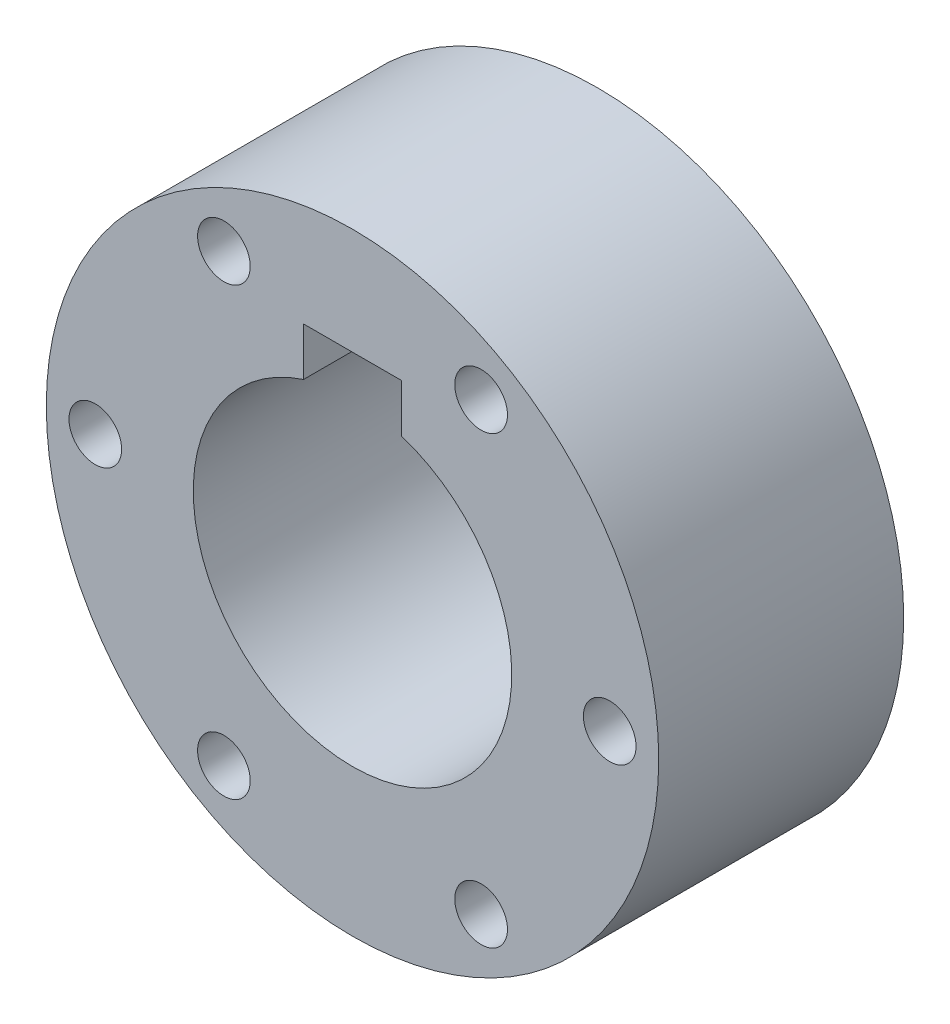
ISO-10303-21;
HEADER;
FILE_DESCRIPTION(('STEP AP214'),'2;1');
FILE_NAME('part.step','',(''),(''),'','','');
FILE_SCHEMA(('AUTOMOTIVE_DESIGN { 1 0 10303 214 1 1 1 1 }'));
ENDSEC;
DATA;
#1=APPLICATION_CONTEXT('core data for automotive mechanical design processes');
#2=APPLICATION_PROTOCOL_DEFINITION('international standard','automotive_design',2000,#1);
#3=PRODUCT_CONTEXT('',#1,'mechanical');
#4=PRODUCT('Part','Part','',(#3));
#5=PRODUCT_RELATED_PRODUCT_CATEGORY('part','',(#4));
#6=PRODUCT_DEFINITION_FORMATION('','',#4);
#7=PRODUCT_DEFINITION_CONTEXT('part definition',#1,'design');
#8=PRODUCT_DEFINITION('design','',#6,#7);
#9=PRODUCT_DEFINITION_SHAPE('','',#8);
#10=(LENGTH_UNIT() NAMED_UNIT(*) SI_UNIT(.MILLI.,.METRE.));
#11=(NAMED_UNIT(*) PLANE_ANGLE_UNIT() SI_UNIT($,.RADIAN.));
#12=(NAMED_UNIT(*) SI_UNIT($,.STERADIAN.) SOLID_ANGLE_UNIT());
#13=UNCERTAINTY_MEASURE_WITH_UNIT(LENGTH_MEASURE(1.E-05),#10,'distance_accuracy_value','');
#14=(GEOMETRIC_REPRESENTATION_CONTEXT(3) GLOBAL_UNCERTAINTY_ASSIGNED_CONTEXT((#13)) GLOBAL_UNIT_ASSIGNED_CONTEXT((#10,
#11,#12)) REPRESENTATION_CONTEXT('',''));
#15=CARTESIAN_POINT('',(0.,0.,0.));
#16=DIRECTION('',(0.,0.,1.));
#17=DIRECTION('',(1.,0.,0.));
#18=AXIS2_PLACEMENT_3D('',#15,#16,#17);
#19=CARTESIAN_POINT('',(0.,0.,20.));
#20=DIRECTION('',(0.,0.,-1.));
#21=DIRECTION('',(-1.,0.,0.));
#22=AXIS2_PLACEMENT_3D('',#19,#20,#21);
#23=CYLINDRICAL_SURFACE('',#22,25.);
#24=CARTESIAN_POINT('',(0.,0.,20.));
#25=DIRECTION('',(0.,0.,1.));
#26=DIRECTION('',(1.,0.,0.));
#27=AXIS2_PLACEMENT_3D('',#24,#25,#26);
#28=CIRCLE('',#27,25.);
#29=CARTESIAN_POINT('',(25.,0.,20.));
#30=VERTEX_POINT('',#29);
#31=EDGE_CURVE('E11',#30,#30,#28,.T.);
#32=ORIENTED_EDGE('',*,*,#31,.F.);
#33=EDGE_LOOP('',(#32));
#34=FACE_BOUND('',#33,.T.);
#35=CARTESIAN_POINT('',(0.,0.,0.));
#36=DIRECTION('',(0.,0.,1.));
#37=DIRECTION('',(1.,0.,0.));
#38=AXIS2_PLACEMENT_3D('',#35,#36,#37);
#39=CIRCLE('',#38,25.);
#40=CARTESIAN_POINT('',(25.,0.,0.));
#41=VERTEX_POINT('',#40);
#42=EDGE_CURVE('E38',#41,#41,#39,.T.);
#43=ORIENTED_EDGE('',*,*,#42,.T.);
#44=EDGE_LOOP('',(#43));
#45=FACE_BOUND('',#44,.T.);
#46=ADVANCED_FACE('F35',(#34,#45),#23,.T.);
#47=CARTESIAN_POINT('',(0.,0.,20.));
#48=DIRECTION('',(0.,0.,1.));
#49=DIRECTION('',(1.,0.,0.));
#50=AXIS2_PLACEMENT_3D('',#47,#48,#49);
#51=PLANE('',#50);
#52=CARTESIAN_POINT('',(21.,0.,20.));
#53=DIRECTION('',(0.,0.,1.));
#54=DIRECTION('',(1.,0.,0.));
#55=AXIS2_PLACEMENT_3D('',#52,#53,#54);
#56=CIRCLE('',#55,2.15);
#57=CARTESIAN_POINT('',(23.15,0.,20.));
#58=VERTEX_POINT('',#57);
#59=EDGE_CURVE('E185',#58,#58,#56,.T.);
#60=ORIENTED_EDGE('',*,*,#59,.F.);
#61=EDGE_LOOP('',(#60));
#62=FACE_BOUND('',#61,.T.);
#63=CARTESIAN_POINT('',(10.5,-18.1865334794732,20.));
#64=DIRECTION('',(0.,0.,1.));
#65=DIRECTION('',(1.,0.,0.));
#66=AXIS2_PLACEMENT_3D('',#63,#64,#65);
#67=CIRCLE('',#66,2.15);
#68=CARTESIAN_POINT('',(12.65,-18.1865334794732,20.));
#69=VERTEX_POINT('',#68);
#70=EDGE_CURVE('E187',#69,#69,#67,.T.);
#71=ORIENTED_EDGE('',*,*,#70,.F.);
#72=EDGE_LOOP('',(#71));
#73=FACE_BOUND('',#72,.T.);
#74=CARTESIAN_POINT('',(-10.5,-18.1865334794732,20.));
#75=DIRECTION('',(0.,0.,1.));
#76=DIRECTION('',(1.,0.,0.));
#77=AXIS2_PLACEMENT_3D('',#74,#75,#76);
#78=CIRCLE('',#77,2.15);
#79=CARTESIAN_POINT('',(-8.35,-18.1865334794732,20.));
#80=VERTEX_POINT('',#79);
#81=EDGE_CURVE('E195',#80,#80,#78,.T.);
#82=ORIENTED_EDGE('',*,*,#81,.F.);
#83=EDGE_LOOP('',(#82));
#84=FACE_BOUND('',#83,.T.);
#85=CARTESIAN_POINT('',(-21.,0.,20.));
#86=DIRECTION('',(0.,0.,1.));
#87=DIRECTION('',(1.,0.,0.));
#88=AXIS2_PLACEMENT_3D('',#85,#86,#87);
#89=CIRCLE('',#88,2.15);
#90=CARTESIAN_POINT('',(-18.85,0.,20.));
#91=VERTEX_POINT('',#90);
#92=EDGE_CURVE('E201',#91,#91,#89,.T.);
#93=ORIENTED_EDGE('',*,*,#92,.F.);
#94=EDGE_LOOP('',(#93));
#95=FACE_BOUND('',#94,.T.);
#96=CARTESIAN_POINT('',(-10.5,18.1865334794732,20.));
#97=DIRECTION('',(0.,0.,1.));
#98=DIRECTION('',(1.,0.,0.));
#99=AXIS2_PLACEMENT_3D('',#96,#97,#98);
#100=CIRCLE('',#99,2.15);
#101=CARTESIAN_POINT('',(-8.35000000000001,18.1865334794732,20.));
#102=VERTEX_POINT('',#101);
#103=EDGE_CURVE('E207',#102,#102,#100,.T.);
#104=ORIENTED_EDGE('',*,*,#103,.F.);
#105=EDGE_LOOP('',(#104));
#106=FACE_BOUND('',#105,.T.);
#107=CARTESIAN_POINT('',(10.5,18.1865334794732,20.));
#108=DIRECTION('',(0.,0.,1.));
#109=DIRECTION('',(1.,0.,0.));
#110=AXIS2_PLACEMENT_3D('',#107,#108,#109);
#111=CIRCLE('',#110,2.15);
#112=CARTESIAN_POINT('',(12.65,18.1865334794732,20.));
#113=VERTEX_POINT('',#112);
#114=EDGE_CURVE('E212',#113,#113,#111,.T.);
#115=ORIENTED_EDGE('',*,*,#114,.F.);
#116=EDGE_LOOP('',(#115));
#117=FACE_BOUND('',#116,.T.);
#118=DIRECTION('',(-1.,0.,0.));
#119=VECTOR('',#118,1.);
#120=CARTESIAN_POINT('',(3.99999999999999,16.3,20.));
#121=LINE('',#120,#119);
#122=CARTESIAN_POINT('',(3.99999999999999,16.3,20.));
#123=VERTEX_POINT('',#122);
#124=CARTESIAN_POINT('',(-4.00000000000001,16.3,20.));
#125=VERTEX_POINT('',#124);
#126=EDGE_CURVE('E49',#123,#125,#121,.T.);
#127=ORIENTED_EDGE('',*,*,#126,.F.);
#128=DIRECTION('',(0.,-1.,0.));
#129=VECTOR('',#128,1.);
#130=CARTESIAN_POINT('',(3.99999999999999,16.3,20.));
#131=LINE('',#130,#129);
#132=CARTESIAN_POINT('',(4.,12.369316876853,20.));
#133=VERTEX_POINT('',#132);
#134=EDGE_CURVE('E93',#123,#133,#131,.T.);
#135=ORIENTED_EDGE('',*,*,#134,.T.);
#136=CARTESIAN_POINT('',(0.,0.,20.));
#137=DIRECTION('',(0.,0.,1.));
#138=DIRECTION('',(1.,0.,0.));
#139=AXIS2_PLACEMENT_3D('',#136,#137,#138);
#140=CIRCLE('',#139,13.);
#141=CARTESIAN_POINT('',(-4.00000000000001,12.369316876853,20.));
#142=VERTEX_POINT('',#141);
#143=EDGE_CURVE('E96',#142,#133,#140,.T.);
#144=ORIENTED_EDGE('',*,*,#143,.F.);
#145=DIRECTION('',(0.,1.,0.));
#146=VECTOR('',#145,1.);
#147=CARTESIAN_POINT('',(-4.00000000000001,12.369316876853,20.));
#148=LINE('',#147,#146);
#149=EDGE_CURVE('E105',#142,#125,#148,.T.);
#150=ORIENTED_EDGE('',*,*,#149,.T.);
#151=EDGE_LOOP('',(#127,#135,#144,#150));
#152=FACE_BOUND('',#151,.T.);
#153=ORIENTED_EDGE('',*,*,#31,.T.);
#154=EDGE_LOOP('',(#153));
#155=FACE_BOUND('',#154,.T.);
#156=ADVANCED_FACE('F116',(#62,#73,#84,#95,#106,#117,#152,#155),#51,.T.);
#157=CARTESIAN_POINT('',(0.,0.,0.));
#158=DIRECTION('',(0.,0.,1.));
#159=DIRECTION('',(1.,0.,0.));
#160=AXIS2_PLACEMENT_3D('',#157,#158,#159);
#161=PLANE('',#160);
#162=CARTESIAN_POINT('',(21.,0.,0.));
#163=DIRECTION('',(0.,0.,1.));
#164=DIRECTION('',(1.,0.,0.));
#165=AXIS2_PLACEMENT_3D('',#162,#163,#164);
#166=CIRCLE('',#165,2.15);
#167=CARTESIAN_POINT('',(23.15,0.,0.));
#168=VERTEX_POINT('',#167);
#169=EDGE_CURVE('E182',#168,#168,#166,.T.);
#170=ORIENTED_EDGE('',*,*,#169,.T.);
#171=EDGE_LOOP('',(#170));
#172=FACE_BOUND('',#171,.T.);
#173=CARTESIAN_POINT('',(10.5,-18.1865334794732,0.));
#174=DIRECTION('',(0.,0.,1.));
#175=DIRECTION('',(1.,0.,0.));
#176=AXIS2_PLACEMENT_3D('',#173,#174,#175);
#177=CIRCLE('',#176,2.15);
#178=CARTESIAN_POINT('',(12.65,-18.1865334794732,0.));
#179=VERTEX_POINT('',#178);
#180=EDGE_CURVE('E192',#179,#179,#177,.T.);
#181=ORIENTED_EDGE('',*,*,#180,.T.);
#182=EDGE_LOOP('',(#181));
#183=FACE_BOUND('',#182,.T.);
#184=CARTESIAN_POINT('',(-10.5,-18.1865334794732,0.));
#185=DIRECTION('',(0.,0.,1.));
#186=DIRECTION('',(1.,0.,0.));
#187=AXIS2_PLACEMENT_3D('',#184,#185,#186);
#188=CIRCLE('',#187,2.15);
#189=CARTESIAN_POINT('',(-8.35,-18.1865334794732,0.));
#190=VERTEX_POINT('',#189);
#191=EDGE_CURVE('E198',#190,#190,#188,.T.);
#192=ORIENTED_EDGE('',*,*,#191,.T.);
#193=EDGE_LOOP('',(#192));
#194=FACE_BOUND('',#193,.T.);
#195=CARTESIAN_POINT('',(-21.,0.,0.));
#196=DIRECTION('',(0.,0.,1.));
#197=DIRECTION('',(1.,0.,0.));
#198=AXIS2_PLACEMENT_3D('',#195,#196,#197);
#199=CIRCLE('',#198,2.15);
#200=CARTESIAN_POINT('',(-18.85,0.,0.));
#201=VERTEX_POINT('',#200);
#202=EDGE_CURVE('E204',#201,#201,#199,.T.);
#203=ORIENTED_EDGE('',*,*,#202,.T.);
#204=EDGE_LOOP('',(#203));
#205=FACE_BOUND('',#204,.T.);
#206=CARTESIAN_POINT('',(-10.5,18.1865334794732,0.));
#207=DIRECTION('',(0.,0.,1.));
#208=DIRECTION('',(1.,0.,0.));
#209=AXIS2_PLACEMENT_3D('',#206,#207,#208);
#210=CIRCLE('',#209,2.15);
#211=CARTESIAN_POINT('',(-8.35000000000001,18.1865334794732,0.));
#212=VERTEX_POINT('',#211);
#213=EDGE_CURVE('E210',#212,#212,#210,.T.);
#214=ORIENTED_EDGE('',*,*,#213,.T.);
#215=EDGE_LOOP('',(#214));
#216=FACE_BOUND('',#215,.T.);
#217=CARTESIAN_POINT('',(10.5,18.1865334794732,0.));
#218=DIRECTION('',(0.,0.,1.));
#219=DIRECTION('',(1.,0.,0.));
#220=AXIS2_PLACEMENT_3D('',#217,#218,#219);
#221=CIRCLE('',#220,2.15);
#222=CARTESIAN_POINT('',(12.65,18.1865334794732,0.));
#223=VERTEX_POINT('',#222);
#224=EDGE_CURVE('E99',#223,#223,#221,.T.);
#225=ORIENTED_EDGE('',*,*,#224,.T.);
#226=EDGE_LOOP('',(#225));
#227=FACE_BOUND('',#226,.T.);
#228=DIRECTION('',(0.,-1.,0.));
#229=VECTOR('',#228,1.);
#230=CARTESIAN_POINT('',(3.99999999999999,16.3,0.));
#231=LINE('',#230,#229);
#232=CARTESIAN_POINT('',(3.99999999999999,16.3,0.));
#233=VERTEX_POINT('',#232);
#234=CARTESIAN_POINT('',(4.,12.369316876853,0.));
#235=VERTEX_POINT('',#234);
#236=EDGE_CURVE('E89',#233,#235,#231,.T.);
#237=ORIENTED_EDGE('',*,*,#236,.F.);
#238=DIRECTION('',(-1.,0.,0.));
#239=VECTOR('',#238,1.);
#240=CARTESIAN_POINT('',(3.99999999999999,16.3,0.));
#241=LINE('',#240,#239);
#242=CARTESIAN_POINT('',(-4.00000000000001,16.3,0.));
#243=VERTEX_POINT('',#242);
#244=EDGE_CURVE('E84',#233,#243,#241,.T.);
#245=ORIENTED_EDGE('',*,*,#244,.T.);
#246=DIRECTION('',(0.,1.,0.));
#247=VECTOR('',#246,1.);
#248=CARTESIAN_POINT('',(-4.00000000000001,12.369316876853,0.));
#249=LINE('',#248,#247);
#250=CARTESIAN_POINT('',(-4.00000000000001,12.369316876853,0.));
#251=VERTEX_POINT('',#250);
#252=EDGE_CURVE('E76',#251,#243,#249,.T.);
#253=ORIENTED_EDGE('',*,*,#252,.F.);
#254=CARTESIAN_POINT('',(0.,0.,0.));
#255=DIRECTION('',(0.,0.,1.));
#256=DIRECTION('',(1.,0.,0.));
#257=AXIS2_PLACEMENT_3D('',#254,#255,#256);
#258=CIRCLE('',#257,13.);
#259=EDGE_CURVE('E57',#251,#235,#258,.T.);
#260=ORIENTED_EDGE('',*,*,#259,.T.);
#261=EDGE_LOOP('',(#237,#245,#253,#260));
#262=FACE_BOUND('',#261,.T.);
#263=ORIENTED_EDGE('',*,*,#42,.F.);
#264=EDGE_LOOP('',(#263));
#265=FACE_BOUND('',#264,.T.);
#266=ADVANCED_FACE('F91',(#172,#183,#194,#205,#216,#227,#262,#265),#161,.F.);
#267=CARTESIAN_POINT('',(3.99999999999999,16.3,0.));
#268=DIRECTION('',(0.,1.,0.));
#269=DIRECTION('',(-1.,0.,0.));
#270=AXIS2_PLACEMENT_3D('',#267,#268,#269);
#271=PLANE('',#270);
#272=ORIENTED_EDGE('',*,*,#126,.T.);
#273=DIRECTION('',(0.,0.,1.));
#274=VECTOR('',#273,1.);
#275=CARTESIAN_POINT('',(-4.00000000000001,16.3,0.));
#276=LINE('',#275,#274);
#277=EDGE_CURVE('E79',#243,#125,#276,.T.);
#278=ORIENTED_EDGE('',*,*,#277,.F.);
#279=ORIENTED_EDGE('',*,*,#244,.F.);
#280=DIRECTION('',(0.,0.,1.));
#281=VECTOR('',#280,1.);
#282=CARTESIAN_POINT('',(3.99999999999999,16.3,0.));
#283=LINE('',#282,#281);
#284=EDGE_CURVE('E109',#233,#123,#283,.T.);
#285=ORIENTED_EDGE('',*,*,#284,.T.);
#286=EDGE_LOOP('',(#272,#278,#279,#285));
#287=FACE_BOUND('',#286,.T.);
#288=ADVANCED_FACE('F87',(#287),#271,.F.);
#289=CARTESIAN_POINT('',(3.99999999999999,16.3,0.));
#290=DIRECTION('',(-1.,0.,0.));
#291=DIRECTION('',(0.,-1.,0.));
#292=AXIS2_PLACEMENT_3D('',#289,#290,#291);
#293=PLANE('',#292);
#294=ORIENTED_EDGE('',*,*,#134,.F.);
#295=ORIENTED_EDGE('',*,*,#284,.F.);
#296=ORIENTED_EDGE('',*,*,#236,.T.);
#297=DIRECTION('',(0.,0.,1.));
#298=VECTOR('',#297,1.);
#299=CARTESIAN_POINT('',(4.,12.369316876853,0.));
#300=LINE('',#299,#298);
#301=EDGE_CURVE('E111',#235,#133,#300,.T.);
#302=ORIENTED_EDGE('',*,*,#301,.T.);
#303=EDGE_LOOP('',(#294,#295,#296,#302));
#304=FACE_BOUND('',#303,.T.);
#305=ADVANCED_FACE('F120',(#304),#293,.T.);
#306=CARTESIAN_POINT('',(0.,0.,0.));
#307=DIRECTION('',(0.,0.,1.));
#308=DIRECTION('',(1.,0.,0.));
#309=AXIS2_PLACEMENT_3D('',#306,#307,#308);
#310=CYLINDRICAL_SURFACE('',#309,13.);
#311=ORIENTED_EDGE('',*,*,#143,.T.);
#312=ORIENTED_EDGE('',*,*,#301,.F.);
#313=ORIENTED_EDGE('',*,*,#259,.F.);
#314=DIRECTION('',(0.,0.,1.));
#315=VECTOR('',#314,1.);
#316=CARTESIAN_POINT('',(-4.00000000000001,12.369316876853,0.));
#317=LINE('',#316,#315);
#318=EDGE_CURVE('E81',#251,#142,#317,.T.);
#319=ORIENTED_EDGE('',*,*,#318,.T.);
#320=EDGE_LOOP('',(#311,#312,#313,#319));
#321=FACE_BOUND('',#320,.T.);
#322=ADVANCED_FACE('F113',(#321),#310,.F.);
#323=CARTESIAN_POINT('',(-4.00000000000001,12.369316876853,0.));
#324=DIRECTION('',(1.,0.,0.));
#325=DIRECTION('',(0.,1.,0.));
#326=AXIS2_PLACEMENT_3D('',#323,#324,#325);
#327=PLANE('',#326);
#328=ORIENTED_EDGE('',*,*,#149,.F.);
#329=ORIENTED_EDGE('',*,*,#318,.F.);
#330=ORIENTED_EDGE('',*,*,#252,.T.);
#331=ORIENTED_EDGE('',*,*,#277,.T.);
#332=EDGE_LOOP('',(#328,#329,#330,#331));
#333=FACE_BOUND('',#332,.T.);
#334=ADVANCED_FACE('F78',(#333),#327,.T.);
#335=CARTESIAN_POINT('',(10.5,18.1865334794732,20.));
#336=DIRECTION('',(0.,0.,1.));
#337=DIRECTION('',(1.,0.,0.));
#338=AXIS2_PLACEMENT_3D('',#335,#336,#337);
#339=CYLINDRICAL_SURFACE('',#338,2.15);
#340=ORIENTED_EDGE('',*,*,#224,.F.);
#341=EDGE_LOOP('',(#340));
#342=FACE_BOUND('',#341,.T.);
#343=ORIENTED_EDGE('',*,*,#114,.T.);
#344=EDGE_LOOP('',(#343));
#345=FACE_BOUND('',#344,.T.);
#346=ADVANCED_FACE('F149',(#342,#345),#339,.F.);
#347=CARTESIAN_POINT('',(-10.5,18.1865334794732,20.));
#348=DIRECTION('',(0.,0.,1.));
#349=DIRECTION('',(1.,0.,0.));
#350=AXIS2_PLACEMENT_3D('',#347,#348,#349);
#351=CYLINDRICAL_SURFACE('',#350,2.15);
#352=ORIENTED_EDGE('',*,*,#213,.F.);
#353=EDGE_LOOP('',(#352));
#354=FACE_BOUND('',#353,.T.);
#355=ORIENTED_EDGE('',*,*,#103,.T.);
#356=EDGE_LOOP('',(#355));
#357=FACE_BOUND('',#356,.T.);
#358=ADVANCED_FACE('F153',(#354,#357),#351,.F.);
#359=CARTESIAN_POINT('',(-21.,0.,20.));
#360=DIRECTION('',(0.,0.,1.));
#361=DIRECTION('',(1.,0.,0.));
#362=AXIS2_PLACEMENT_3D('',#359,#360,#361);
#363=CYLINDRICAL_SURFACE('',#362,2.15);
#364=ORIENTED_EDGE('',*,*,#202,.F.);
#365=EDGE_LOOP('',(#364));
#366=FACE_BOUND('',#365,.T.);
#367=ORIENTED_EDGE('',*,*,#92,.T.);
#368=EDGE_LOOP('',(#367));
#369=FACE_BOUND('',#368,.T.);
#370=ADVANCED_FACE('F158',(#366,#369),#363,.F.);
#371=CARTESIAN_POINT('',(-10.5,-18.1865334794732,20.));
#372=DIRECTION('',(0.,0.,1.));
#373=DIRECTION('',(1.,0.,0.));
#374=AXIS2_PLACEMENT_3D('',#371,#372,#373);
#375=CYLINDRICAL_SURFACE('',#374,2.15);
#376=ORIENTED_EDGE('',*,*,#191,.F.);
#377=EDGE_LOOP('',(#376));
#378=FACE_BOUND('',#377,.T.);
#379=ORIENTED_EDGE('',*,*,#81,.T.);
#380=EDGE_LOOP('',(#379));
#381=FACE_BOUND('',#380,.T.);
#382=ADVANCED_FACE('F166',(#378,#381),#375,.F.);
#383=CARTESIAN_POINT('',(10.5,-18.1865334794732,20.));
#384=DIRECTION('',(0.,0.,1.));
#385=DIRECTION('',(1.,0.,0.));
#386=AXIS2_PLACEMENT_3D('',#383,#384,#385);
#387=CYLINDRICAL_SURFACE('',#386,2.15);
#388=ORIENTED_EDGE('',*,*,#180,.F.);
#389=EDGE_LOOP('',(#388));
#390=FACE_BOUND('',#389,.T.);
#391=ORIENTED_EDGE('',*,*,#70,.T.);
#392=EDGE_LOOP('',(#391));
#393=FACE_BOUND('',#392,.T.);
#394=ADVANCED_FACE('F170',(#390,#393),#387,.F.);
#395=CARTESIAN_POINT('',(21.,0.,20.));
#396=DIRECTION('',(0.,0.,1.));
#397=DIRECTION('',(1.,0.,0.));
#398=AXIS2_PLACEMENT_3D('',#395,#396,#397);
#399=CYLINDRICAL_SURFACE('',#398,2.15);
#400=ORIENTED_EDGE('',*,*,#169,.F.);
#401=EDGE_LOOP('',(#400));
#402=FACE_BOUND('',#401,.T.);
#403=ORIENTED_EDGE('',*,*,#59,.T.);
#404=EDGE_LOOP('',(#403));
#405=FACE_BOUND('',#404,.T.);
#406=ADVANCED_FACE('F174',(#402,#405),#399,.F.);
#407=CLOSED_SHELL('',(#46,#156,#266,#288,#305,#322,#334,#346,#358,#370,#382,#394,#406));
#408=MANIFOLD_SOLID_BREP('B2',#407);
#409=ADVANCED_BREP_SHAPE_REPRESENTATION('',(#18,#408),#14);
#410=SHAPE_DEFINITION_REPRESENTATION(#9,#409);
ENDSEC;
END-ISO-10303-21;
